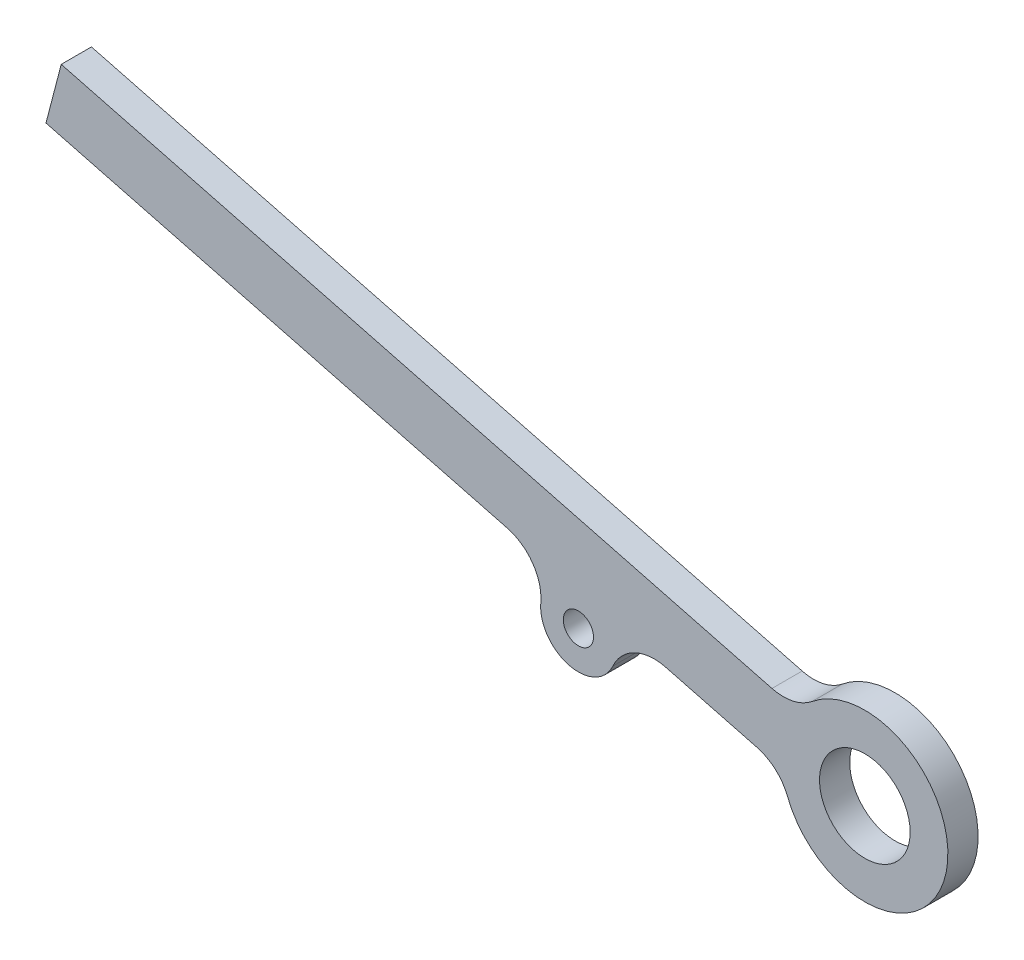
ISO-10303-21;
HEADER;
FILE_DESCRIPTION(('STEP AP214'),'2;1');
FILE_NAME('part.step','',(''),(''),'','','');
FILE_SCHEMA(('AUTOMOTIVE_DESIGN { 1 0 10303 214 1 1 1 1 }'));
ENDSEC;
DATA;
#1=APPLICATION_CONTEXT('core data for automotive mechanical design processes');
#2=APPLICATION_PROTOCOL_DEFINITION('international standard','automotive_design',2000,#1);
#3=PRODUCT_CONTEXT('',#1,'mechanical');
#4=PRODUCT('Part','Part','',(#3));
#5=PRODUCT_RELATED_PRODUCT_CATEGORY('part','',(#4));
#6=PRODUCT_DEFINITION_FORMATION('','',#4);
#7=PRODUCT_DEFINITION_CONTEXT('part definition',#1,'design');
#8=PRODUCT_DEFINITION('design','',#6,#7);
#9=PRODUCT_DEFINITION_SHAPE('','',#8);
#10=(LENGTH_UNIT() NAMED_UNIT(*) SI_UNIT(.MILLI.,.METRE.));
#11=(NAMED_UNIT(*) PLANE_ANGLE_UNIT() SI_UNIT($,.RADIAN.));
#12=(NAMED_UNIT(*) SI_UNIT($,.STERADIAN.) SOLID_ANGLE_UNIT());
#13=UNCERTAINTY_MEASURE_WITH_UNIT(LENGTH_MEASURE(1.E-05),#10,'distance_accuracy_value','');
#14=(GEOMETRIC_REPRESENTATION_CONTEXT(3) GLOBAL_UNCERTAINTY_ASSIGNED_CONTEXT((#13)) GLOBAL_UNIT_ASSIGNED_CONTEXT((#10,
#11,#12)) REPRESENTATION_CONTEXT('',''));
#15=CARTESIAN_POINT('',(0.,0.,0.));
#16=DIRECTION('',(0.,0.,1.));
#17=DIRECTION('',(1.,0.,0.));
#18=AXIS2_PLACEMENT_3D('',#15,#16,#17);
#19=CARTESIAN_POINT('',(-5.47757202561479,0.496190189546625,2.));
#20=DIRECTION('',(0.,0.,1.));
#21=DIRECTION('',(1.,0.,0.));
#22=AXIS2_PLACEMENT_3D('',#19,#20,#21);
#23=PLANE('',#22);
#24=CARTESIAN_POINT('',(0.,0.,2.));
#25=DIRECTION('',(0.,0.,1.));
#26=DIRECTION('',(1.,0.,0.));
#27=AXIS2_PLACEMENT_3D('',#24,#25,#26);
#28=CIRCLE('',#27,1.);
#29=CARTESIAN_POINT('',(1.,0.,2.));
#30=VERTEX_POINT('',#29);
#31=EDGE_CURVE('E156',#30,#30,#28,.T.);
#32=ORIENTED_EDGE('',*,*,#31,.F.);
#33=EDGE_LOOP('',(#32));
#34=FACE_BOUND('',#33,.T.);
#35=CARTESIAN_POINT('',(-5.47757202561479,0.496190189546625,2.));
#36=DIRECTION('',(0.,0.,-1.));
#37=DIRECTION('',(1.,0.,0.));
#38=AXIS2_PLACEMENT_3D('',#35,#36,#37);
#39=CIRCLE('',#38,3.);
#40=CARTESIAN_POINT('',(-4.72146075760536,3.39934291553077,2.));
#41=VERTEX_POINT('',#40);
#42=CARTESIAN_POINT('',(-2.48980546618854,0.225540995248466,2.));
#43=VERTEX_POINT('',#42);
#44=EDGE_CURVE('E171',#41,#43,#39,.T.);
#45=ORIENTED_EDGE('',*,*,#44,.T.);
#46=CARTESIAN_POINT('',(0.,0.,2.));
#47=DIRECTION('',(0.,0.,1.));
#48=DIRECTION('',(1.,0.,0.));
#49=AXIS2_PLACEMENT_3D('',#46,#47,#48);
#50=CIRCLE('',#49,2.5);
#51=CARTESIAN_POINT('',(2.28350638540001,-1.01764364481746,2.));
#52=VERTEX_POINT('',#51);
#53=EDGE_CURVE('E109',#43,#52,#50,.T.);
#54=ORIENTED_EDGE('',*,*,#53,.T.);
#55=CARTESIAN_POINT('',(5.02371404788003,-2.23881601859842,2.));
#56=DIRECTION('',(0.,0.,-1.));
#57=DIRECTION('',(-1.,0.,0.));
#58=AXIS2_PLACEMENT_3D('',#55,#56,#57);
#59=CIRCLE('',#58,3.);
#60=CARTESIAN_POINT('',(5.77982531588945,0.664336707385726,2.));
#61=VERTEX_POINT('',#60);
#62=EDGE_CURVE('E192',#52,#61,#59,.T.);
#63=ORIENTED_EDGE('',*,*,#62,.T.);
#64=DIRECTION('',(0.967717575328049,-0.252037089336474,0.));
#65=VECTOR('',#64,1.);
#66=CARTESIAN_POINT('',(11.8081511787544,-0.905709908263693,2.));
#67=LINE('',#66,#65);
#68=CARTESIAN_POINT('',(11.8081511787544,-0.905709908263693,2.));
#69=VERTEX_POINT('',#68);
#70=EDGE_CURVE('E211',#61,#69,#67,.T.);
#71=ORIENTED_EDGE('',*,*,#70,.T.);
#72=CARTESIAN_POINT('',(11.052039910745,-3.80886263424784,2.));
#73=DIRECTION('',(0.,0.,-1.));
#74=DIRECTION('',(1.,0.,0.));
#75=AXIS2_PLACEMENT_3D('',#72,#73,#74);
#76=CIRCLE('',#75,3.);
#77=CARTESIAN_POINT('',(13.8445613250163,-2.71258522827991,2.));
#78=VERTEX_POINT('',#77);
#79=EDGE_CURVE('E208',#69,#78,#76,.T.);
#80=ORIENTED_EDGE('',*,*,#79,.T.);
#81=CARTESIAN_POINT('',(18.9641839178472,-0.702743317338704,2.));
#82=DIRECTION('',(0.,0.,1.));
#83=DIRECTION('',(1.,0.,0.));
#84=AXIS2_PLACEMENT_3D('',#81,#82,#83);
#85=CIRCLE('',#84,5.5);
#86=CARTESIAN_POINT('',(15.4753895501347,3.54911672972511,2.));
#87=VERTEX_POINT('',#86);
#88=EDGE_CURVE('E210',#78,#87,#85,.T.);
#89=ORIENTED_EDGE('',*,*,#88,.T.);
#90=CARTESIAN_POINT('',(13.5724108041097,5.86831311903265,2.));
#91=DIRECTION('',(0.,0.,-1.));
#92=DIRECTION('',(-1.,0.,0.));
#93=AXIS2_PLACEMENT_3D('',#90,#91,#92);
#94=CIRCLE('',#93,3.);
#95=CARTESIAN_POINT('',(12.8162995361003,2.9651603930485,2.));
#96=VERTEX_POINT('',#95);
#97=EDGE_CURVE('E134',#87,#96,#94,.T.);
#98=ORIENTED_EDGE('',*,*,#97,.T.);
#99=DIRECTION('',(-0.967717575328049,0.252037089336474,0.));
#100=VECTOR('',#99,1.);
#101=CARTESIAN_POINT('',(12.8162995361003,2.9651603930485,2.));
#102=LINE('',#101,#100);
#103=CARTESIAN_POINT('',(-34.2400673341866,15.2207502914917,2.));
#104=VERTEX_POINT('',#103);
#105=EDGE_CURVE('E128',#96,#104,#102,.T.);
#106=ORIENTED_EDGE('',*,*,#105,.T.);
#107=DIRECTION('',(-0.252037089336476,-0.967717575328049,0.));
#108=VECTOR('',#107,1.);
#109=CARTESIAN_POINT('',(-34.2400673341866,15.2207502914917,2.));
#110=LINE('',#109,#108);
#111=CARTESIAN_POINT('',(-35.2482156915325,11.3498799901795,2.));
#112=VERTEX_POINT('',#111);
#113=EDGE_CURVE('E132',#104,#112,#110,.T.);
#114=ORIENTED_EDGE('',*,*,#113,.T.);
#115=DIRECTION('',(0.967717575328049,-0.252037089336474,0.));
#116=VECTOR('',#115,1.);
#117=CARTESIAN_POINT('',(-4.72146075760536,3.39934291553077,2.));
#118=LINE('',#117,#116);
#119=EDGE_CURVE('E60',#112,#41,#118,.T.);
#120=ORIENTED_EDGE('',*,*,#119,.T.);
#121=EDGE_LOOP('',(#45,#54,#63,#71,#80,#89,#98,#106,#114,#120));
#122=FACE_BOUND('',#121,.T.);
#123=CARTESIAN_POINT('',(18.9641839178472,-0.702743317338704,2.));
#124=DIRECTION('',(0.,0.,1.));
#125=DIRECTION('',(1.,0.,0.));
#126=AXIS2_PLACEMENT_3D('',#123,#124,#125);
#127=CIRCLE('',#126,3.);
#128=CARTESIAN_POINT('',(21.9641839178472,-0.702743317338704,2.));
#129=VERTEX_POINT('',#128);
#130=EDGE_CURVE('E222',#129,#129,#127,.T.);
#131=ORIENTED_EDGE('',*,*,#130,.F.);
#132=EDGE_LOOP('',(#131));
#133=FACE_BOUND('',#132,.T.);
#134=ADVANCED_FACE('F43',(#34,#122,#133),#23,.T.);
#135=CARTESIAN_POINT('',(-5.47757202561479,0.496190189546625,0.));
#136=DIRECTION('',(0.,0.,1.));
#137=DIRECTION('',(1.,0.,0.));
#138=AXIS2_PLACEMENT_3D('',#135,#136,#137);
#139=PLANE('',#138);
#140=CARTESIAN_POINT('',(-5.47757202561479,0.496190189546625,0.));
#141=DIRECTION('',(0.,0.,-1.));
#142=DIRECTION('',(1.,0.,0.));
#143=AXIS2_PLACEMENT_3D('',#140,#141,#142);
#144=CIRCLE('',#143,3.);
#145=CARTESIAN_POINT('',(-4.72146075760536,3.39934291553077,0.));
#146=VERTEX_POINT('',#145);
#147=CARTESIAN_POINT('',(-2.48980546618854,0.225540995248466,0.));
#148=VERTEX_POINT('',#147);
#149=EDGE_CURVE('E152',#146,#148,#144,.T.);
#150=ORIENTED_EDGE('',*,*,#149,.F.);
#151=DIRECTION('',(0.967717575328049,-0.252037089336474,0.));
#152=VECTOR('',#151,1.);
#153=CARTESIAN_POINT('',(-4.72146075760536,3.39934291553077,0.));
#154=LINE('',#153,#152);
#155=CARTESIAN_POINT('',(-35.2482156915325,11.3498799901795,0.));
#156=VERTEX_POINT('',#155);
#157=EDGE_CURVE('E101',#156,#146,#154,.T.);
#158=ORIENTED_EDGE('',*,*,#157,.F.);
#159=DIRECTION('',(-0.252037089336476,-0.967717575328049,0.));
#160=VECTOR('',#159,1.);
#161=CARTESIAN_POINT('',(-34.2400673341866,15.2207502914917,0.));
#162=LINE('',#161,#160);
#163=CARTESIAN_POINT('',(-34.2400673341866,15.2207502914917,0.));
#164=VERTEX_POINT('',#163);
#165=EDGE_CURVE('E95',#164,#156,#162,.T.);
#166=ORIENTED_EDGE('',*,*,#165,.F.);
#167=DIRECTION('',(-0.967717575328049,0.252037089336474,0.));
#168=VECTOR('',#167,1.);
#169=CARTESIAN_POINT('',(12.8162995361003,2.9651603930485,0.));
#170=LINE('',#169,#168);
#171=CARTESIAN_POINT('',(12.8162995361003,2.9651603930485,0.));
#172=VERTEX_POINT('',#171);
#173=EDGE_CURVE('E142',#172,#164,#170,.T.);
#174=ORIENTED_EDGE('',*,*,#173,.F.);
#175=CARTESIAN_POINT('',(13.5724108041097,5.86831311903265,0.));
#176=DIRECTION('',(0.,0.,-1.));
#177=DIRECTION('',(-1.,0.,0.));
#178=AXIS2_PLACEMENT_3D('',#175,#176,#177);
#179=CIRCLE('',#178,3.);
#180=CARTESIAN_POINT('',(15.4753895501347,3.54911672972511,0.));
#181=VERTEX_POINT('',#180);
#182=EDGE_CURVE('E166',#181,#172,#179,.T.);
#183=ORIENTED_EDGE('',*,*,#182,.F.);
#184=CARTESIAN_POINT('',(18.9641839178472,-0.702743317338704,0.));
#185=DIRECTION('',(0.,0.,1.));
#186=DIRECTION('',(1.,0.,0.));
#187=AXIS2_PLACEMENT_3D('',#184,#185,#186);
#188=CIRCLE('',#187,5.5);
#189=CARTESIAN_POINT('',(13.8445613250163,-2.71258522827991,0.));
#190=VERTEX_POINT('',#189);
#191=EDGE_CURVE('E164',#190,#181,#188,.T.);
#192=ORIENTED_EDGE('',*,*,#191,.F.);
#193=CARTESIAN_POINT('',(11.052039910745,-3.80886263424784,0.));
#194=DIRECTION('',(0.,0.,-1.));
#195=DIRECTION('',(1.,0.,0.));
#196=AXIS2_PLACEMENT_3D('',#193,#194,#195);
#197=CIRCLE('',#196,3.);
#198=CARTESIAN_POINT('',(11.8081511787544,-0.905709908263693,0.));
#199=VERTEX_POINT('',#198);
#200=EDGE_CURVE('E162',#199,#190,#197,.T.);
#201=ORIENTED_EDGE('',*,*,#200,.F.);
#202=DIRECTION('',(0.967717575328049,-0.252037089336474,0.));
#203=VECTOR('',#202,1.);
#204=CARTESIAN_POINT('',(11.8081511787544,-0.905709908263693,0.));
#205=LINE('',#204,#203);
#206=CARTESIAN_POINT('',(5.77982531588945,0.664336707385726,0.));
#207=VERTEX_POINT('',#206);
#208=EDGE_CURVE('E160',#207,#199,#205,.T.);
#209=ORIENTED_EDGE('',*,*,#208,.F.);
#210=CARTESIAN_POINT('',(5.02371404788003,-2.23881601859842,0.));
#211=DIRECTION('',(0.,0.,-1.));
#212=DIRECTION('',(-1.,0.,0.));
#213=AXIS2_PLACEMENT_3D('',#210,#211,#212);
#214=CIRCLE('',#213,3.);
#215=CARTESIAN_POINT('',(2.28350638540001,-1.01764364481746,0.));
#216=VERTEX_POINT('',#215);
#217=EDGE_CURVE('E158',#216,#207,#214,.T.);
#218=ORIENTED_EDGE('',*,*,#217,.F.);
#219=CARTESIAN_POINT('',(0.,0.,0.));
#220=DIRECTION('',(0.,0.,1.));
#221=DIRECTION('',(1.,0.,0.));
#222=AXIS2_PLACEMENT_3D('',#219,#220,#221);
#223=CIRCLE('',#222,2.5);
#224=EDGE_CURVE('E155',#148,#216,#223,.T.);
#225=ORIENTED_EDGE('',*,*,#224,.F.);
#226=EDGE_LOOP('',(#150,#158,#166,#174,#183,#192,#201,#209,#218,#225));
#227=FACE_BOUND('',#226,.T.);
#228=CARTESIAN_POINT('',(0.,0.,0.));
#229=DIRECTION('',(0.,0.,1.));
#230=DIRECTION('',(1.,0.,0.));
#231=AXIS2_PLACEMENT_3D('',#228,#229,#230);
#232=CIRCLE('',#231,1.);
#233=CARTESIAN_POINT('',(1.,0.,0.));
#234=VERTEX_POINT('',#233);
#235=EDGE_CURVE('E219',#234,#234,#232,.T.);
#236=ORIENTED_EDGE('',*,*,#235,.T.);
#237=EDGE_LOOP('',(#236));
#238=FACE_BOUND('',#237,.T.);
#239=CARTESIAN_POINT('',(18.9641839178472,-0.702743317338704,0.));
#240=DIRECTION('',(0.,0.,1.));
#241=DIRECTION('',(1.,0.,0.));
#242=AXIS2_PLACEMENT_3D('',#239,#240,#241);
#243=CIRCLE('',#242,3.);
#244=CARTESIAN_POINT('',(21.9641839178472,-0.702743317338704,0.));
#245=VERTEX_POINT('',#244);
#246=EDGE_CURVE('E225',#245,#245,#243,.T.);
#247=ORIENTED_EDGE('',*,*,#246,.T.);
#248=EDGE_LOOP('',(#247));
#249=FACE_BOUND('',#248,.T.);
#250=ADVANCED_FACE('F196',(#227,#238,#249),#139,.F.);
#251=CARTESIAN_POINT('',(-5.47757202561479,0.496190189546625,2.));
#252=DIRECTION('',(0.,0.,-1.));
#253=DIRECTION('',(-1.,0.,0.));
#254=AXIS2_PLACEMENT_3D('',#251,#252,#253);
#255=CYLINDRICAL_SURFACE('',#254,3.);
#256=ORIENTED_EDGE('',*,*,#149,.T.);
#257=DIRECTION('',(0.,0.,-1.));
#258=VECTOR('',#257,1.);
#259=CARTESIAN_POINT('',(-2.48980546618854,0.225540995248466,2.));
#260=LINE('',#259,#258);
#261=EDGE_CURVE('E13',#43,#148,#260,.T.);
#262=ORIENTED_EDGE('',*,*,#261,.F.);
#263=ORIENTED_EDGE('',*,*,#44,.F.);
#264=DIRECTION('',(0.,0.,-1.));
#265=VECTOR('',#264,1.);
#266=CARTESIAN_POINT('',(-4.72146075760536,3.39934291553077,2.));
#267=LINE('',#266,#265);
#268=EDGE_CURVE('E148',#41,#146,#267,.T.);
#269=ORIENTED_EDGE('',*,*,#268,.T.);
#270=EDGE_LOOP('',(#256,#262,#263,#269));
#271=FACE_BOUND('',#270,.T.);
#272=ADVANCED_FACE('F45',(#271),#255,.F.);
#273=CARTESIAN_POINT('',(0.,0.,2.));
#274=DIRECTION('',(0.,0.,-1.));
#275=DIRECTION('',(-1.,0.,0.));
#276=AXIS2_PLACEMENT_3D('',#273,#274,#275);
#277=CYLINDRICAL_SURFACE('',#276,2.5);
#278=ORIENTED_EDGE('',*,*,#224,.T.);
#279=DIRECTION('',(0.,0.,-1.));
#280=VECTOR('',#279,1.);
#281=CARTESIAN_POINT('',(2.28350638540001,-1.01764364481746,2.));
#282=LINE('',#281,#280);
#283=EDGE_CURVE('E52',#52,#216,#282,.T.);
#284=ORIENTED_EDGE('',*,*,#283,.F.);
#285=ORIENTED_EDGE('',*,*,#53,.F.);
#286=ORIENTED_EDGE('',*,*,#261,.T.);
#287=EDGE_LOOP('',(#278,#284,#285,#286));
#288=FACE_BOUND('',#287,.T.);
#289=ADVANCED_FACE('F265',(#288),#277,.T.);
#290=CARTESIAN_POINT('',(5.02371404788003,-2.23881601859842,2.));
#291=DIRECTION('',(0.,0.,-1.));
#292=DIRECTION('',(-1.,0.,0.));
#293=AXIS2_PLACEMENT_3D('',#290,#291,#292);
#294=CYLINDRICAL_SURFACE('',#293,3.);
#295=ORIENTED_EDGE('',*,*,#217,.T.);
#296=DIRECTION('',(0.,0.,-1.));
#297=VECTOR('',#296,1.);
#298=CARTESIAN_POINT('',(5.77982531588945,0.664336707385726,2.));
#299=LINE('',#298,#297);
#300=EDGE_CURVE('E184',#61,#207,#299,.T.);
#301=ORIENTED_EDGE('',*,*,#300,.F.);
#302=ORIENTED_EDGE('',*,*,#62,.F.);
#303=ORIENTED_EDGE('',*,*,#283,.T.);
#304=EDGE_LOOP('',(#295,#301,#302,#303));
#305=FACE_BOUND('',#304,.T.);
#306=ADVANCED_FACE('F190',(#305),#294,.F.);
#307=CARTESIAN_POINT('',(11.8081511787544,-0.905709908263693,2.));
#308=DIRECTION('',(0.252037089336474,0.967717575328049,0.));
#309=DIRECTION('',(-0.967717575328049,0.252037089336474,0.));
#310=AXIS2_PLACEMENT_3D('',#307,#308,#309);
#311=PLANE('',#310);
#312=ORIENTED_EDGE('',*,*,#208,.T.);
#313=DIRECTION('',(0.,0.,-1.));
#314=VECTOR('',#313,1.);
#315=CARTESIAN_POINT('',(11.8081511787544,-0.905709908263693,2.));
#316=LINE('',#315,#314);
#317=EDGE_CURVE('E181',#69,#199,#316,.T.);
#318=ORIENTED_EDGE('',*,*,#317,.F.);
#319=ORIENTED_EDGE('',*,*,#70,.F.);
#320=ORIENTED_EDGE('',*,*,#300,.T.);
#321=EDGE_LOOP('',(#312,#318,#319,#320));
#322=FACE_BOUND('',#321,.T.);
#323=ADVANCED_FACE('F202',(#322),#311,.F.);
#324=CARTESIAN_POINT('',(11.052039910745,-3.80886263424784,2.));
#325=DIRECTION('',(0.,0.,-1.));
#326=DIRECTION('',(-1.,0.,0.));
#327=AXIS2_PLACEMENT_3D('',#324,#325,#326);
#328=CYLINDRICAL_SURFACE('',#327,3.);
#329=ORIENTED_EDGE('',*,*,#200,.T.);
#330=DIRECTION('',(0.,0.,-1.));
#331=VECTOR('',#330,1.);
#332=CARTESIAN_POINT('',(13.8445613250163,-2.71258522827991,2.));
#333=LINE('',#332,#331);
#334=EDGE_CURVE('E178',#78,#190,#333,.T.);
#335=ORIENTED_EDGE('',*,*,#334,.F.);
#336=ORIENTED_EDGE('',*,*,#79,.F.);
#337=ORIENTED_EDGE('',*,*,#317,.T.);
#338=EDGE_LOOP('',(#329,#335,#336,#337));
#339=FACE_BOUND('',#338,.T.);
#340=ADVANCED_FACE('F206',(#339),#328,.F.);
#341=CARTESIAN_POINT('',(18.9641839178472,-0.702743317338704,2.));
#342=DIRECTION('',(0.,0.,-1.));
#343=DIRECTION('',(-1.,0.,0.));
#344=AXIS2_PLACEMENT_3D('',#341,#342,#343);
#345=CYLINDRICAL_SURFACE('',#344,5.5);
#346=ORIENTED_EDGE('',*,*,#191,.T.);
#347=DIRECTION('',(0.,0.,-1.));
#348=VECTOR('',#347,1.);
#349=CARTESIAN_POINT('',(15.4753895501347,3.54911672972511,2.));
#350=LINE('',#349,#348);
#351=EDGE_CURVE('E175',#87,#181,#350,.T.);
#352=ORIENTED_EDGE('',*,*,#351,.F.);
#353=ORIENTED_EDGE('',*,*,#88,.F.);
#354=ORIENTED_EDGE('',*,*,#334,.T.);
#355=EDGE_LOOP('',(#346,#352,#353,#354));
#356=FACE_BOUND('',#355,.T.);
#357=ADVANCED_FACE('F255',(#356),#345,.T.);
#358=CARTESIAN_POINT('',(13.5724108041097,5.86831311903265,2.));
#359=DIRECTION('',(0.,0.,-1.));
#360=DIRECTION('',(-1.,0.,0.));
#361=AXIS2_PLACEMENT_3D('',#358,#359,#360);
#362=CYLINDRICAL_SURFACE('',#361,3.);
#363=ORIENTED_EDGE('',*,*,#182,.T.);
#364=DIRECTION('',(0.,0.,-1.));
#365=VECTOR('',#364,1.);
#366=CARTESIAN_POINT('',(12.8162995361003,2.9651603930485,2.));
#367=LINE('',#366,#365);
#368=EDGE_CURVE('E143',#96,#172,#367,.T.);
#369=ORIENTED_EDGE('',*,*,#368,.F.);
#370=ORIENTED_EDGE('',*,*,#97,.F.);
#371=ORIENTED_EDGE('',*,*,#351,.T.);
#372=EDGE_LOOP('',(#363,#369,#370,#371));
#373=FACE_BOUND('',#372,.T.);
#374=ADVANCED_FACE('F252',(#373),#362,.F.);
#375=CARTESIAN_POINT('',(12.8162995361003,2.9651603930485,2.));
#376=DIRECTION('',(-0.252037089336474,-0.967717575328049,0.));
#377=DIRECTION('',(0.967717575328049,-0.252037089336474,0.));
#378=AXIS2_PLACEMENT_3D('',#375,#376,#377);
#379=PLANE('',#378);
#380=ORIENTED_EDGE('',*,*,#173,.T.);
#381=DIRECTION('',(0.,0.,-1.));
#382=VECTOR('',#381,1.);
#383=CARTESIAN_POINT('',(-34.2400673341866,15.2207502914917,2.));
#384=LINE('',#383,#382);
#385=EDGE_CURVE('E139',#104,#164,#384,.T.);
#386=ORIENTED_EDGE('',*,*,#385,.F.);
#387=ORIENTED_EDGE('',*,*,#105,.F.);
#388=ORIENTED_EDGE('',*,*,#368,.T.);
#389=EDGE_LOOP('',(#380,#386,#387,#388));
#390=FACE_BOUND('',#389,.T.);
#391=ADVANCED_FACE('F140',(#390),#379,.F.);
#392=CARTESIAN_POINT('',(-34.2400673341866,15.2207502914917,2.));
#393=DIRECTION('',(0.967717575328049,-0.252037089336476,0.));
#394=DIRECTION('',(0.252037089336476,0.967717575328049,0.));
#395=AXIS2_PLACEMENT_3D('',#392,#393,#394);
#396=PLANE('',#395);
#397=ORIENTED_EDGE('',*,*,#165,.T.);
#398=DIRECTION('',(0.,0.,-1.));
#399=VECTOR('',#398,1.);
#400=CARTESIAN_POINT('',(-35.2482156915325,11.3498799901795,2.));
#401=LINE('',#400,#399);
#402=EDGE_CURVE('E144',#112,#156,#401,.T.);
#403=ORIENTED_EDGE('',*,*,#402,.F.);
#404=ORIENTED_EDGE('',*,*,#113,.F.);
#405=ORIENTED_EDGE('',*,*,#385,.T.);
#406=EDGE_LOOP('',(#397,#403,#404,#405));
#407=FACE_BOUND('',#406,.T.);
#408=ADVANCED_FACE('F146',(#407),#396,.F.);
#409=CARTESIAN_POINT('',(-4.72146075760536,3.39934291553077,2.));
#410=DIRECTION('',(0.252037089336474,0.967717575328049,0.));
#411=DIRECTION('',(-0.967717575328049,0.252037089336474,0.));
#412=AXIS2_PLACEMENT_3D('',#409,#410,#411);
#413=PLANE('',#412);
#414=ORIENTED_EDGE('',*,*,#157,.T.);
#415=ORIENTED_EDGE('',*,*,#268,.F.);
#416=ORIENTED_EDGE('',*,*,#119,.F.);
#417=ORIENTED_EDGE('',*,*,#402,.T.);
#418=EDGE_LOOP('',(#414,#415,#416,#417));
#419=FACE_BOUND('',#418,.T.);
#420=ADVANCED_FACE('F245',(#419),#413,.F.);
#421=CARTESIAN_POINT('',(0.,0.,2.));
#422=DIRECTION('',(0.,0.,-1.));
#423=DIRECTION('',(-1.,0.,0.));
#424=AXIS2_PLACEMENT_3D('',#421,#422,#423);
#425=CYLINDRICAL_SURFACE('',#424,1.);
#426=ORIENTED_EDGE('',*,*,#31,.T.);
#427=EDGE_LOOP('',(#426));
#428=FACE_BOUND('',#427,.T.);
#429=ORIENTED_EDGE('',*,*,#235,.F.);
#430=EDGE_LOOP('',(#429));
#431=FACE_BOUND('',#430,.T.);
#432=ADVANCED_FACE('F242',(#428,#431),#425,.F.);
#433=CARTESIAN_POINT('',(18.9641839178472,-0.702743317338704,2.));
#434=DIRECTION('',(0.,0.,-1.));
#435=DIRECTION('',(-1.,0.,0.));
#436=AXIS2_PLACEMENT_3D('',#433,#434,#435);
#437=CYLINDRICAL_SURFACE('',#436,3.);
#438=ORIENTED_EDGE('',*,*,#130,.T.);
#439=EDGE_LOOP('',(#438));
#440=FACE_BOUND('',#439,.T.);
#441=ORIENTED_EDGE('',*,*,#246,.F.);
#442=EDGE_LOOP('',(#441));
#443=FACE_BOUND('',#442,.T.);
#444=ADVANCED_FACE('F231',(#440,#443),#437,.F.);
#445=CLOSED_SHELL('',(#134,#250,#272,#289,#306,#323,#340,#357,#374,#391,#408,#420,#432,#444));
#446=MANIFOLD_SOLID_BREP('B2',#445);
#447=ADVANCED_BREP_SHAPE_REPRESENTATION('',(#18,#446),#14);
#448=SHAPE_DEFINITION_REPRESENTATION(#9,#447);
ENDSEC;
END-ISO-10303-21;
